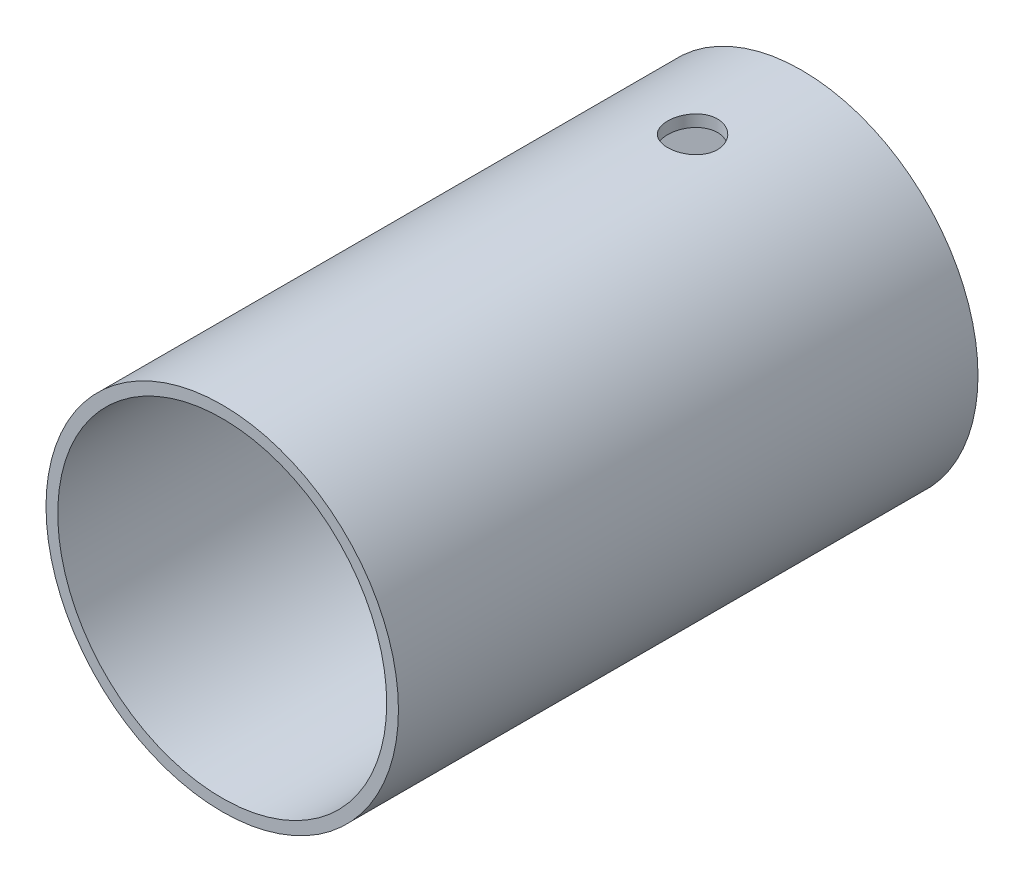
ISO-10303-21;
HEADER;
FILE_DESCRIPTION(('STEP AP214'),'2;1');
FILE_NAME('part.step','',(''),(''),'','','');
FILE_SCHEMA(('AUTOMOTIVE_DESIGN { 1 0 10303 214 1 1 1 1 }'));
ENDSEC;
DATA;
#1=APPLICATION_CONTEXT('core data for automotive mechanical design processes');
#2=APPLICATION_PROTOCOL_DEFINITION('international standard','automotive_design',2000,#1);
#3=PRODUCT_CONTEXT('',#1,'mechanical');
#4=PRODUCT('Part','Part','',(#3));
#5=PRODUCT_RELATED_PRODUCT_CATEGORY('part','',(#4));
#6=PRODUCT_DEFINITION_FORMATION('','',#4);
#7=PRODUCT_DEFINITION_CONTEXT('part definition',#1,'design');
#8=PRODUCT_DEFINITION('design','',#6,#7);
#9=PRODUCT_DEFINITION_SHAPE('','',#8);
#10=(LENGTH_UNIT() NAMED_UNIT(*) SI_UNIT(.MILLI.,.METRE.));
#11=(NAMED_UNIT(*) PLANE_ANGLE_UNIT() SI_UNIT($,.RADIAN.));
#12=(NAMED_UNIT(*) SI_UNIT($,.STERADIAN.) SOLID_ANGLE_UNIT());
#13=UNCERTAINTY_MEASURE_WITH_UNIT(LENGTH_MEASURE(1.E-05),#10,'distance_accuracy_value','');
#14=(GEOMETRIC_REPRESENTATION_CONTEXT(3) GLOBAL_UNCERTAINTY_ASSIGNED_CONTEXT((#13)) GLOBAL_UNIT_ASSIGNED_CONTEXT((#10,
#11,#12)) REPRESENTATION_CONTEXT('',''));
#15=CARTESIAN_POINT('',(0.,0.,0.));
#16=DIRECTION('',(0.,0.,1.));
#17=DIRECTION('',(1.,0.,0.));
#18=AXIS2_PLACEMENT_3D('',#15,#16,#17);
#19=CARTESIAN_POINT('',(0.,0.,4.));
#20=DIRECTION('',(0.,0.,-1.));
#21=DIRECTION('',(-1.,0.,0.));
#22=AXIS2_PLACEMENT_3D('',#19,#20,#21);
#23=CYLINDRICAL_SURFACE('',#22,22.5);
#24=CARTESIAN_POINT('',(0.,22.5,17.1238170210701));
#25=CARTESIAN_POINT('',(0.177672288481125,22.499997271361,17.1238096072423));
#26=CARTESIAN_POINT('',(0.355450589169007,22.497873385631,17.1088764705483));
#27=CARTESIAN_POINT('',(0.706046164663328,22.489605147934,17.049548967872));
#28=CARTESIAN_POINT('',(0.878858300273064,22.4834567773281,17.0051251534206));
#29=CARTESIAN_POINT('',(1.2143963254882,22.4678311360997,16.8881633162471));
#30=CARTESIAN_POINT('',(1.37712943510187,22.4583562815892,16.815645694847));
#31=CARTESIAN_POINT('',(1.68808973200263,22.4371271376579,16.6446027656903));
#32=CARTESIAN_POINT('',(1.83631910195524,22.4253731920133,16.5460813795129));
#33=CARTESIAN_POINT('',(2.1151242029156,22.4008032784509,16.3250952783988));
#34=CARTESIAN_POINT('',(2.24558423973172,22.3879811522732,16.2024852684078));
#35=CARTESIAN_POINT('',(2.48414982811849,22.3627687372986,15.9371148657469));
#36=CARTESIAN_POINT('',(2.59225414983107,22.3503784722909,15.7943533652069));
#37=CARTESIAN_POINT('',(2.78348321581258,22.327372682542,15.4919640030735));
#38=CARTESIAN_POINT('',(2.86649726789299,22.3167651113169,15.3322654830012));
#39=CARTESIAN_POINT('',(3.00448213620182,22.2986089303408,15.0010179283415));
#40=CARTESIAN_POINT('',(3.05945430855333,22.2910601726671,14.8294694672803));
#41=CARTESIAN_POINT('',(3.13943834168445,22.2799363358042,14.480603095263));
#42=CARTESIAN_POINT('',(3.16464736294919,22.2763351183799,14.3033312353768));
#43=CARTESIAN_POINT('',(3.18500003309428,22.2734345557902,13.9470395518492));
#44=CARTESIAN_POINT('',(3.18014521756415,22.2741349909066,13.7680198179514));
#45=CARTESIAN_POINT('',(3.14066940825402,22.2797346802687,13.4146999506859));
#46=CARTESIAN_POINT('',(3.10626711220296,22.284603084157,13.2403748235814));
#47=CARTESIAN_POINT('',(3.00901483262699,22.2979420067743,12.8999965779224));
#48=CARTESIAN_POINT('',(2.94616412743772,22.3064126168818,12.7339436693318));
#49=CARTESIAN_POINT('',(2.79356889390839,22.3260359458603,12.4141529595462));
#50=CARTESIAN_POINT('',(2.70373085298936,22.3371979636272,12.2604603739011));
#51=CARTESIAN_POINT('',(2.49977782321002,22.3609395532324,11.9702490782086));
#52=CARTESIAN_POINT('',(2.38566141758379,22.3735192077767,11.8337313711427));
#53=CARTESIAN_POINT('',(2.13518629214513,22.398815291992,11.5804768678846));
#54=CARTESIAN_POINT('',(1.99863936493184,22.4115319455726,11.4639261553969));
#55=CARTESIAN_POINT('',(1.70782311584279,22.4355653505839,11.2553681263739));
#56=CARTESIAN_POINT('',(1.5535537312831,22.4468820970629,11.1633608966523));
#57=CARTESIAN_POINT('',(1.23151694426422,22.4668505613097,11.0064954882689));
#58=CARTESIAN_POINT('',(1.06374294593177,22.4755009667097,10.9416506732751));
#59=CARTESIAN_POINT('',(0.719537574473752,22.4891508232601,10.8411074007493));
#60=CARTESIAN_POINT('',(0.543106721068688,22.4941504932995,10.8054071957639));
#61=CARTESIAN_POINT('',(0.18820296401957,22.4999067644648,10.764411682093));
#62=CARTESIAN_POINT('',(0.00976019036643094,22.5006990914248,10.7588603608195));
#63=CARTESIAN_POINT('',(-0.345509474221062,22.4980483624597,10.7776420956525));
#64=CARTESIAN_POINT('',(-0.522336409282952,22.4946054225474,10.8019743331858));
#65=CARTESIAN_POINT('',(-0.868586812527726,22.4838931402194,10.8796196561555));
#66=CARTESIAN_POINT('',(-1.03803858122633,22.4766401416249,10.9328089864585));
#67=CARTESIAN_POINT('',(-1.36561850799912,22.4591188105257,11.0665288167249));
#68=CARTESIAN_POINT('',(-1.52374618648833,22.4488503504075,11.1470604738311));
#69=CARTESIAN_POINT('',(-1.82532151056054,22.4263515647349,11.3337864551315));
#70=CARTESIAN_POINT('',(-1.96866693718524,22.4141089080239,11.4401443575238));
#71=CARTESIAN_POINT('',(-2.23556469002255,22.3890654933808,11.6752746407295));
#72=CARTESIAN_POINT('',(-2.35911600056744,22.3762647068531,11.8040481710177));
#73=CARTESIAN_POINT('',(-2.58384142810954,22.3514355812859,12.0814897302175));
#74=CARTESIAN_POINT('',(-2.68484461370742,22.3394136027091,12.230296866644));
#75=CARTESIAN_POINT('',(-2.86042123389754,22.3176130192256,12.5429148085857));
#76=CARTESIAN_POINT('',(-2.93499531782207,22.3078343592053,12.7067252453627));
#77=CARTESIAN_POINT('',(-3.05532756409345,22.2916727192566,13.0441748130963));
#78=CARTESIAN_POINT('',(-3.10117802483069,22.2852788731851,13.2177804879732));
#79=CARTESIAN_POINT('',(-3.16305662235749,22.2765811009583,13.5703244342777));
#80=CARTESIAN_POINT('',(-3.17908656889905,22.2742769266088,13.7492623814298));
#81=CARTESIAN_POINT('',(-3.18082965238209,22.2740279313309,14.1056890370617));
#82=CARTESIAN_POINT('',(-3.16681145094478,22.2760444786021,14.2831764636293));
#83=CARTESIAN_POINT('',(-3.10942939579073,22.2841260876231,14.6332436757036));
#84=CARTESIAN_POINT('',(-3.06606556899766,22.2901911456585,14.8058234657127));
#85=CARTESIAN_POINT('',(-2.95131426166393,22.3056734608835,15.141116280143));
#86=CARTESIAN_POINT('',(-2.87994344200687,22.3150887247826,15.3038351043699));
#87=CARTESIAN_POINT('',(-2.71123060429157,22.336213303566,15.6150318196469));
#88=CARTESIAN_POINT('',(-2.6138879074884,22.347922678402,15.7635093383791));
#89=CARTESIAN_POINT('',(-2.3950105402061,22.3724411018698,16.0433770086536));
#90=CARTESIAN_POINT('',(-2.27327635253199,22.3852586884151,16.1746103904841));
#91=CARTESIAN_POINT('',(-2.00949240811249,22.4104765073139,16.4148841071509));
#92=CARTESIAN_POINT('',(-1.86743791410815,22.4228766415121,16.523919252524));
#93=CARTESIAN_POINT('',(-1.56623899579993,22.4459305995242,16.7171682286545));
#94=CARTESIAN_POINT('',(-1.40701482848964,22.4565756384854,16.8012587845507));
#95=CARTESIAN_POINT('',(-1.07663317002347,22.4748331182308,16.9413810412334));
#96=CARTESIAN_POINT('',(-0.905488480555714,22.4824487550981,16.9974423296201));
#97=CARTESIAN_POINT('',(-0.611275952628239,22.4920149518847,17.0669373795637));
#98=CARTESIAN_POINT('',(-0.490039532637624,22.494994259292,17.0882353707683));
#99=CARTESIAN_POINT('',(-0.245885657114234,22.4989877173636,17.1166776833435));
#100=CARTESIAN_POINT('',(-0.122968219115601,22.5000018885099,17.1238221522315));
#101=CARTESIAN_POINT('',(0.,22.5,17.1238170210701));
#102=B_SPLINE_CURVE_WITH_KNOTS('',3,(#24,#25,#26,#27,#28,#29,#30,#31,#32,#33,#34,#35,#36,#37,
#38,#39,#40,#41,#42,#43,#44,#45,#46,#47,#48,#49,#50,#51,#52,#53,#54,#55,#56,#57,#58,#59,#60,#61,
#62,#63,#64,#65,#66,#67,#68,#69,#70,#71,#72,#73,#74,#75,#76,#77,#78,#79,#80,#81,#82,#83,#84,#85,
#86,#87,#88,#89,#90,#91,#92,#93,#94,#95,#96,#97,#98,#99,#100,#101),.UNSPECIFIED.,.T.,.F.,(4,2,2,
2,2,2,2,2,2,2,2,2,2,2,2,2,2,2,2,2,2,2,2,2,2,2,2,2,2,2,2,2,2,2,2,2,2,2,4),(0.,0.532567592144649,
1.0656677912006,1.59838158397833,2.13101508504144,2.66696576772654,3.20294592690223,
3.7412572983355,4.27954263422063,4.81424182704764,5.34891370893246,5.87966195173324,
6.41042365903213,6.94304612454361,7.47569967981124,8.01307514275869,8.55045250644966,
9.08809394540199,9.62570314606449,10.1587399566562,10.6917621665802,11.2225163471008,
11.7532929922421,12.2875234229697,12.8217812571405,13.3599611268053,13.8981277730996,
14.4345561223673,14.9709519157257,15.502571790578,16.0341911776866,16.5654947917228,
17.0968122921241,17.6326676472179,18.168648130113,18.7072348844186,19.2452519016518,
19.6138494556334,19.9824431678243),.UNSPECIFIED.);
#103=CARTESIAN_POINT('',(0.,22.5,17.1238170210701));
#104=VERTEX_POINT('',#103);
#105=EDGE_CURVE('E51',#104,#104,#102,.T.);
#106=ORIENTED_EDGE('',*,*,#105,.F.);
#107=EDGE_LOOP('',(#106));
#108=FACE_BOUND('',#107,.T.);
#109=CARTESIAN_POINT('',(0.,0.,0.));
#110=DIRECTION('',(0.,0.,1.));
#111=DIRECTION('',(1.,0.,0.));
#112=AXIS2_PLACEMENT_3D('',#109,#110,#111);
#113=CIRCLE('',#112,22.5);
#114=CARTESIAN_POINT('',(22.5,0.,0.));
#115=VERTEX_POINT('',#114);
#116=EDGE_CURVE('E38',#115,#115,#113,.T.);
#117=ORIENTED_EDGE('',*,*,#116,.T.);
#118=EDGE_LOOP('',(#117));
#119=FACE_BOUND('',#118,.T.);
#120=CARTESIAN_POINT('',(0.,0.,74.));
#121=DIRECTION('',(0.,0.,1.));
#122=DIRECTION('',(1.,0.,0.));
#123=AXIS2_PLACEMENT_3D('',#120,#121,#122);
#124=CIRCLE('',#123,22.5);
#125=CARTESIAN_POINT('',(22.5,0.,74.));
#126=VERTEX_POINT('',#125);
#127=EDGE_CURVE('E42',#126,#126,#124,.T.);
#128=ORIENTED_EDGE('',*,*,#127,.F.);
#129=EDGE_LOOP('',(#128));
#130=FACE_BOUND('',#129,.T.);
#131=ADVANCED_FACE('F32',(#108,#119,#130),#23,.T.);
#132=CARTESIAN_POINT('',(0.,0.,0.));
#133=DIRECTION('',(0.,0.,1.));
#134=DIRECTION('',(1.,0.,0.));
#135=AXIS2_PLACEMENT_3D('',#132,#133,#134);
#136=PLANE('',#135);
#137=ORIENTED_EDGE('',*,*,#116,.F.);
#138=EDGE_LOOP('',(#137));
#139=FACE_BOUND('',#138,.T.);
#140=ADVANCED_FACE('F78',(#139),#136,.F.);
#141=CARTESIAN_POINT('',(0.,0.,74.));
#142=DIRECTION('',(0.,0.,1.));
#143=DIRECTION('',(1.,0.,0.));
#144=AXIS2_PLACEMENT_3D('',#141,#142,#143);
#145=PLANE('',#144);
#146=ORIENTED_EDGE('',*,*,#127,.T.);
#147=EDGE_LOOP('',(#146));
#148=FACE_BOUND('',#147,.T.);
#149=CARTESIAN_POINT('',(0.,0.,74.));
#150=DIRECTION('',(0.,0.,1.));
#151=DIRECTION('',(1.,0.,0.));
#152=AXIS2_PLACEMENT_3D('',#149,#150,#151);
#153=CIRCLE('',#152,21.);
#154=CARTESIAN_POINT('',(21.,0.,74.));
#155=VERTEX_POINT('',#154);
#156=EDGE_CURVE('E46',#155,#155,#153,.T.);
#157=ORIENTED_EDGE('',*,*,#156,.F.);
#158=EDGE_LOOP('',(#157));
#159=FACE_BOUND('',#158,.T.);
#160=ADVANCED_FACE('F74',(#148,#159),#145,.T.);
#161=CARTESIAN_POINT('',(0.,0.,74.));
#162=DIRECTION('',(0.,0.,-1.));
#163=DIRECTION('',(-1.,0.,0.));
#164=AXIS2_PLACEMENT_3D('',#161,#162,#163);
#165=CYLINDRICAL_SURFACE('',#164,21.);
#166=CARTESIAN_POINT('',(0.,21.,17.1238170210701));
#167=CARTESIAN_POINT('',(0.17753299949852,20.9999971361099,17.123809715276));
#168=CARTESIAN_POINT('',(0.355168512686467,20.9977251350121,17.1088998635144));
#169=CARTESIAN_POINT('',(0.705472977212092,20.9888803456446,17.0496702904916));
#170=CARTESIAN_POINT('',(0.878136945239405,20.9823033888752,17.0053220633855));
#171=CARTESIAN_POINT('',(1.21337813776443,20.9655876744641,16.8885724368128));
#172=CARTESIAN_POINT('',(1.37596292858887,20.9554516276382,16.8161923837515));
#173=CARTESIAN_POINT('',(1.6866548454915,20.9327373086382,16.6454861835428));
#174=CARTESIAN_POINT('',(1.83476394929121,20.9201593707874,16.5471635875709));
#175=CARTESIAN_POINT('',(2.11350298177733,20.8938477281836,16.3265300009604));
#176=CARTESIAN_POINT('',(2.24400106541251,20.8801064377346,16.2040533299533));
#177=CARTESIAN_POINT('',(2.48267605168851,20.8530760848186,15.9389447895518));
#178=CARTESIAN_POINT('',(2.59085166060151,20.8397870485998,15.796311752776));
#179=CARTESIAN_POINT('',(2.78232547711281,20.8150922337944,15.4940518137425));
#180=CARTESIAN_POINT('',(2.86549588868982,20.8036962584509,15.3343430855777));
#181=CARTESIAN_POINT('',(3.00378166997989,20.7841815544413,15.0030217458143));
#182=CARTESIAN_POINT('',(3.05889859833738,20.7760626437074,14.8314097961579));
#183=CARTESIAN_POINT('',(3.13910289281809,20.7640959664,14.4825409702013));
#184=CARTESIAN_POINT('',(3.16441613757174,20.760216089081,14.3053371445945));
#185=CARTESIAN_POINT('',(3.18499431356418,20.7570693111365,13.9491578022832));
#186=CARTESIAN_POINT('',(3.18026100267655,20.7578021406446,13.7701823898371));
#187=CARTESIAN_POINT('',(3.14106497152173,20.7637686170158,13.4171373370244));
#188=CARTESIAN_POINT('',(3.10685400180981,20.7689641495058,13.2430390096211));
#189=CARTESIAN_POINT('',(3.0100679482392,20.7832110752336,12.9030825125608));
#190=CARTESIAN_POINT('',(2.9474920479456,20.7922625794583,12.7372245802416));
#191=CARTESIAN_POINT('',(2.79549113708288,20.8132435944957,12.4176920140428));
#192=CARTESIAN_POINT('',(2.70595966346078,20.8251844797328,12.264068801863));
#193=CARTESIAN_POINT('',(2.50266487734211,20.8505906229653,11.9739309581145));
#194=CARTESIAN_POINT('',(2.38889994448941,20.8640559828655,11.8374174715476));
#195=CARTESIAN_POINT('',(2.13898654966814,20.8911621912427,11.5839152927856));
#196=CARTESIAN_POINT('',(2.00262167749501,20.9048034290918,11.4671398833134));
#197=CARTESIAN_POINT('',(1.71211642104369,20.930596902099,11.2580992824858));
#198=CARTESIAN_POINT('',(1.55797595621197,20.942749130509,11.1658342022101));
#199=CARTESIAN_POINT('',(1.23610884244608,20.9642084076989,11.0084216670551));
#200=CARTESIAN_POINT('',(1.06837392634216,20.9735137085089,10.9432908633652));
#201=CARTESIAN_POINT('',(0.724174762665684,20.9882161081464,10.8421821518726));
#202=CARTESIAN_POINT('',(0.54771111753129,20.9936134762901,10.8062022351088));
#203=CARTESIAN_POINT('',(0.192904230948963,20.999856158792,10.764700695842));
#204=CARTESIAN_POINT('',(0.0145960258779194,21.0007452884385,10.7588858876587));
#205=CARTESIAN_POINT('',(-0.340449041203416,20.9979906426882,10.7771011387452));
#206=CARTESIAN_POINT('',(-0.517185952640069,20.9943470103849,10.8011302558799));
#207=CARTESIAN_POINT('',(-0.863182021471861,20.9829633462627,10.8781074565503));
#208=CARTESIAN_POINT('',(-1.03247372359618,20.9752435802224,10.9309125127607));
#209=CARTESIAN_POINT('',(-1.35980089775758,20.9565703817865,11.0637916862197));
#210=CARTESIAN_POINT('',(-1.51783583201333,20.9456167950266,11.1438671052287));
#211=CARTESIAN_POINT('',(-1.8194513577483,20.9215841611794,11.3297004499609));
#212=CARTESIAN_POINT('',(-1.96291627758909,20.9084899790146,11.4356441222747));
#213=CARTESIAN_POINT('',(-2.23013483549437,20.8816801855177,11.6699482676536));
#214=CARTESIAN_POINT('',(-2.35388730402431,20.8679645373761,11.7983100698339));
#215=CARTESIAN_POINT('',(-2.57923651867216,20.8413184924832,12.0751127716617));
#216=CARTESIAN_POINT('',(-2.68063660086866,20.8283957361065,12.2237146261094));
#217=CARTESIAN_POINT('',(-2.85703514403543,20.8049345615955,12.5360141032295));
#218=CARTESIAN_POINT('',(-2.93203432901693,20.7943960780784,12.6997113117755));
#219=CARTESIAN_POINT('',(-3.05319819455972,20.7769521259235,13.0369712962171));
#220=CARTESIAN_POINT('',(-3.09946590832011,20.770033689745,13.210496356099));
#221=CARTESIAN_POINT('',(-3.16218109370106,20.7605788375912,13.5629667733097));
#222=CARTESIAN_POINT('',(-3.17863066758389,20.7580421126936,13.7419117476148));
#223=CARTESIAN_POINT('',(-3.18119191019815,20.757649581564,14.0981819046447));
#224=CARTESIAN_POINT('',(-3.16761282766111,20.7597460603571,14.2755048889092));
#225=CARTESIAN_POINT('',(-3.11116541205992,20.7682799446968,14.6253141395073));
#226=CARTESIAN_POINT('',(-3.06829712955493,20.77471734275,14.7978004141894));
#227=CARTESIAN_POINT('',(-2.95459829905023,20.7911909319226,15.1329515076906));
#228=CARTESIAN_POINT('',(-2.88378977834122,20.8012242875211,15.2956239472672));
#229=CARTESIAN_POINT('',(-2.71625131555738,20.8237626768925,15.6068301138652));
#230=CARTESIAN_POINT('',(-2.61952046194377,20.8362677975791,15.7553633434433));
#231=CARTESIAN_POINT('',(-2.40176125548668,20.8624939394538,16.035645253628));
#232=CARTESIAN_POINT('',(-2.28050398435392,20.8762256794977,16.1672150989036));
#233=CARTESIAN_POINT('',(-2.01761776253345,20.9032686859464,16.4082488728691));
#234=CARTESIAN_POINT('',(-1.87598408653456,20.9165798539444,16.5177076597855));
#235=CARTESIAN_POINT('',(-1.57542897106406,20.9413674010556,16.7119624181523));
#236=CARTESIAN_POINT('',(-1.41641492251103,20.952833057678,16.7966164506705));
#237=CARTESIAN_POINT('',(-1.08632565168032,20.9725326515907,16.9378876705772));
#238=CARTESIAN_POINT('',(-0.915263091688967,20.980769923663,16.9945338048265));
#239=CARTESIAN_POINT('',(-0.619534591565241,20.9912111051036,17.0653757990134));
#240=CARTESIAN_POINT('',(-0.496691209002185,20.9944899575395,17.0872576336663));
#241=CARTESIAN_POINT('',(-0.249248714832142,20.9988853965631,17.1164807165139));
#242=CARTESIAN_POINT('',(-0.124649625693946,21.000002010797,17.1238221506206));
#243=CARTESIAN_POINT('',(0.,21.,17.1238170210701));
#244=B_SPLINE_CURVE_WITH_KNOTS('',3,(#166,#167,#168,#169,#170,#171,#172,#173,#174,#175,#176,
#177,#178,#179,#180,#181,#182,#183,#184,#185,#186,#187,#188,#189,#190,#191,#192,#193,#194,#195,
#196,#197,#198,#199,#200,#201,#202,#203,#204,#205,#206,#207,#208,#209,#210,#211,#212,#213,#214,
#215,#216,#217,#218,#219,#220,#221,#222,#223,#224,#225,#226,#227,#228,#229,#230,#231,#232,#233,
#234,#235,#236,#237,#238,#239,#240,#241,#242,#243),.UNSPECIFIED.,.T.,.F.,(4,2,2,2,2,2,2,2,2,2,2,
2,2,2,2,2,2,2,2,2,2,2,2,2,2,2,2,2,2,2,2,2,2,2,2,2,2,2,4),(0.,0.532143503227379,1.06480304619433,
1.59705776073286,2.1292396547267,2.66520755990278,3.20120651907172,3.7399000203225,
4.2785635886304,4.81311785874373,5.34764085505042,5.87764356234371,6.40766152580663,
6.9398009255033,7.47197591756602,8.00957735214765,8.54718122306951,9.08511451515367,
9.62301073189788,10.1556690104098,10.6883104740014,11.2183283390515,11.74837150824,
12.2823387488451,12.8163376577956,13.3548623302598,13.893372233215,14.4299396754742,
14.9664692867563,15.4974992292151,16.0285282550097,16.5591394663629,17.0897693386972,
17.625601582652,18.1615582876047,18.7005245174227,19.238932541726,19.6125663833431,
19.9861954476868),.UNSPECIFIED.);
#245=CARTESIAN_POINT('',(0.,21.,17.1238170210701));
#246=VERTEX_POINT('',#245);
#247=EDGE_CURVE('E58',#246,#246,#244,.T.);
#248=ORIENTED_EDGE('',*,*,#247,.T.);
#249=EDGE_LOOP('',(#248));
#250=FACE_BOUND('',#249,.T.);
#251=ORIENTED_EDGE('',*,*,#156,.T.);
#252=EDGE_LOOP('',(#251));
#253=FACE_BOUND('',#252,.T.);
#254=CARTESIAN_POINT('',(0.,0.,4.));
#255=DIRECTION('',(0.,0.,1.));
#256=DIRECTION('',(1.,0.,0.));
#257=AXIS2_PLACEMENT_3D('',#254,#255,#256);
#258=CIRCLE('',#257,21.);
#259=CARTESIAN_POINT('',(21.,0.,4.));
#260=VERTEX_POINT('',#259);
#261=EDGE_CURVE('E11',#260,#260,#258,.F.);
#262=ORIENTED_EDGE('',*,*,#261,.T.);
#263=EDGE_LOOP('',(#262));
#264=FACE_BOUND('',#263,.T.);
#265=ADVANCED_FACE('F70',(#250,#253,#264),#165,.F.);
#266=CARTESIAN_POINT('',(0.,0.,4.));
#267=DIRECTION('',(0.,0.,1.));
#268=DIRECTION('',(1.,0.,0.));
#269=AXIS2_PLACEMENT_3D('',#266,#267,#268);
#270=PLANE('',#269);
#271=ORIENTED_EDGE('',*,*,#261,.F.);
#272=EDGE_LOOP('',(#271));
#273=FACE_BOUND('',#272,.T.);
#274=ADVANCED_FACE('F68',(#273),#270,.T.);
#275=CARTESIAN_POINT('',(0.,0.,13.9438170210701));
#276=DIRECTION('',(0.,1.,0.));
#277=DIRECTION('',(0.,0.,1.));
#278=AXIS2_PLACEMENT_3D('',#275,#276,#277);
#279=CYLINDRICAL_SURFACE('',#278,3.18);
#280=ORIENTED_EDGE('',*,*,#247,.F.);
#281=EDGE_LOOP('',(#280));
#282=FACE_BOUND('',#281,.T.);
#283=ORIENTED_EDGE('',*,*,#105,.T.);
#284=EDGE_LOOP('',(#283));
#285=FACE_BOUND('',#284,.T.);
#286=ADVANCED_FACE('F62',(#282,#285),#279,.F.);
#287=CLOSED_SHELL('',(#131,#140,#160,#265,#274,#286));
#288=MANIFOLD_SOLID_BREP('B2',#287);
#289=ADVANCED_BREP_SHAPE_REPRESENTATION('',(#18,#288),#14);
#290=SHAPE_DEFINITION_REPRESENTATION(#9,#289);
ENDSEC;
END-ISO-10303-21;
